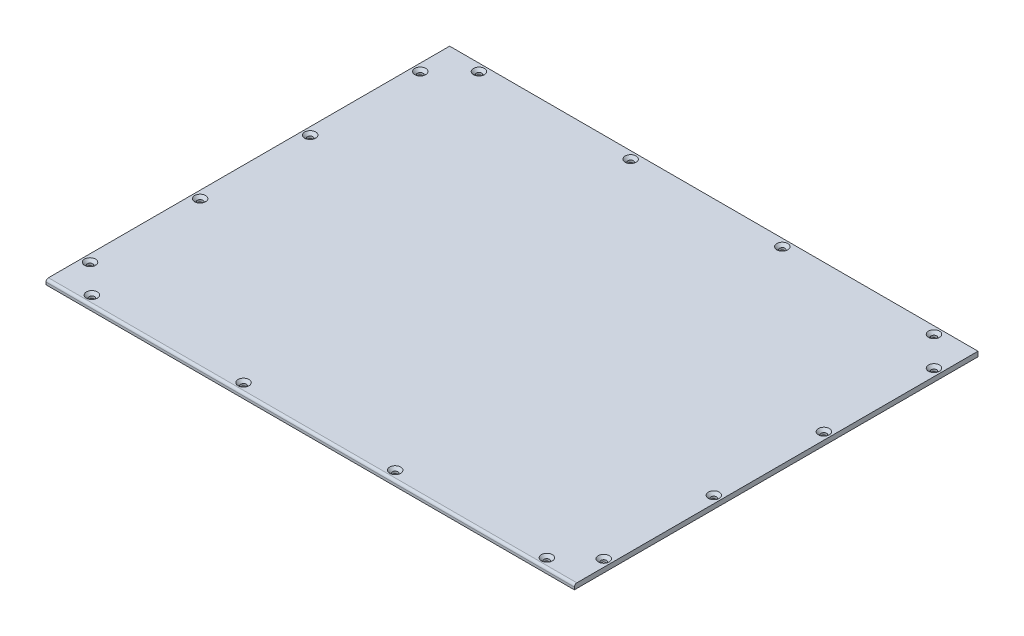
ISO-10303-21;
HEADER;
FILE_DESCRIPTION(('STEP AP214'),'2;1');
FILE_NAME('part.step','',(''),(''),'','','');
FILE_SCHEMA(('AUTOMOTIVE_DESIGN { 1 0 10303 214 1 1 1 1 }'));
ENDSEC;
DATA;
#1=APPLICATION_CONTEXT('core data for automotive mechanical design processes');
#2=APPLICATION_PROTOCOL_DEFINITION('international standard','automotive_design',2000,#1);
#3=PRODUCT_CONTEXT('',#1,'mechanical');
#4=PRODUCT('Part','Part','',(#3));
#5=PRODUCT_RELATED_PRODUCT_CATEGORY('part','',(#4));
#6=PRODUCT_DEFINITION_FORMATION('','',#4);
#7=PRODUCT_DEFINITION_CONTEXT('part definition',#1,'design');
#8=PRODUCT_DEFINITION('design','',#6,#7);
#9=PRODUCT_DEFINITION_SHAPE('','',#8);
#10=(LENGTH_UNIT() NAMED_UNIT(*) SI_UNIT(.MILLI.,.METRE.));
#11=(NAMED_UNIT(*) PLANE_ANGLE_UNIT() SI_UNIT($,.RADIAN.));
#12=(NAMED_UNIT(*) SI_UNIT($,.STERADIAN.) SOLID_ANGLE_UNIT());
#13=UNCERTAINTY_MEASURE_WITH_UNIT(LENGTH_MEASURE(1.E-05),#10,'distance_accuracy_value','');
#14=(GEOMETRIC_REPRESENTATION_CONTEXT(3) GLOBAL_UNCERTAINTY_ASSIGNED_CONTEXT((#13)) GLOBAL_UNIT_ASSIGNED_CONTEXT((#10,
#11,#12)) REPRESENTATION_CONTEXT('',''));
#15=CARTESIAN_POINT('',(0.,0.,0.));
#16=DIRECTION('',(0.,0.,1.));
#17=DIRECTION('',(1.,0.,0.));
#18=AXIS2_PLACEMENT_3D('',#15,#16,#17);
#19=CARTESIAN_POINT('',(0.,4.,0.));
#20=DIRECTION('',(1.,0.,0.));
#21=DIRECTION('',(0.,0.,-1.));
#22=AXIS2_PLACEMENT_3D('',#19,#20,#21);
#23=PLANE('',#22);
#24=DIRECTION('',(0.,-1.,0.));
#25=VECTOR('',#24,1.);
#26=CARTESIAN_POINT('',(0.,4.,0.));
#27=LINE('',#26,#25);
#28=CARTESIAN_POINT('',(0.,2.,0.));
#29=VERTEX_POINT('',#28);
#30=CARTESIAN_POINT('',(0.,0.,0.));
#31=VERTEX_POINT('',#30);
#32=EDGE_CURVE('E119',#29,#31,#27,.T.);
#33=ORIENTED_EDGE('',*,*,#32,.F.);
#34=CARTESIAN_POINT('',(0.,2.,-2.));
#35=DIRECTION('',(1.,0.,0.));
#36=DIRECTION('',(0.,0.,-1.));
#37=AXIS2_PLACEMENT_3D('',#34,#35,#36);
#38=CIRCLE('',#37,2.);
#39=CARTESIAN_POINT('',(0.,4.,-2.));
#40=VERTEX_POINT('',#39);
#41=EDGE_CURVE('E11',#29,#40,#38,.F.);
#42=ORIENTED_EDGE('',*,*,#41,.T.);
#43=DIRECTION('',(0.,0.,1.));
#44=VECTOR('',#43,1.);
#45=CARTESIAN_POINT('',(0.,4.,0.));
#46=LINE('',#45,#44);
#47=CARTESIAN_POINT('',(0.,4.,-330.));
#48=VERTEX_POINT('',#47);
#49=EDGE_CURVE('E89',#48,#40,#46,.T.);
#50=ORIENTED_EDGE('',*,*,#49,.F.);
#51=DIRECTION('',(0.,-1.,0.));
#52=VECTOR('',#51,1.);
#53=CARTESIAN_POINT('',(0.,4.,-330.));
#54=LINE('',#53,#52);
#55=CARTESIAN_POINT('',(0.,0.,-330.));
#56=VERTEX_POINT('',#55);
#57=EDGE_CURVE('E99',#48,#56,#54,.T.);
#58=ORIENTED_EDGE('',*,*,#57,.T.);
#59=DIRECTION('',(0.,0.,1.));
#60=VECTOR('',#59,1.);
#61=CARTESIAN_POINT('',(0.,0.,0.));
#62=LINE('',#61,#60);
#63=EDGE_CURVE('E108',#56,#31,#62,.T.);
#64=ORIENTED_EDGE('',*,*,#63,.T.);
#65=EDGE_LOOP('',(#33,#42,#50,#58,#64));
#66=FACE_BOUND('',#65,.T.);
#67=ADVANCED_FACE('F36',(#66),#23,.F.);
#68=CARTESIAN_POINT('',(0.,4.,0.));
#69=DIRECTION('',(0.,0.,-1.));
#70=DIRECTION('',(-1.,0.,0.));
#71=AXIS2_PLACEMENT_3D('',#68,#69,#70);
#72=PLANE('',#71);
#73=DIRECTION('',(0.,-1.,0.));
#74=VECTOR('',#73,1.);
#75=CARTESIAN_POINT('',(432.,4.,0.));
#76=LINE('',#75,#74);
#77=CARTESIAN_POINT('',(432.,2.,0.));
#78=VERTEX_POINT('',#77);
#79=CARTESIAN_POINT('',(432.,0.,0.));
#80=VERTEX_POINT('',#79);
#81=EDGE_CURVE('E98',#78,#80,#76,.T.);
#82=ORIENTED_EDGE('',*,*,#81,.F.);
#83=DIRECTION('',(1.,0.,0.));
#84=VECTOR('',#83,1.);
#85=CARTESIAN_POINT('',(0.,2.,0.));
#86=LINE('',#85,#84);
#87=EDGE_CURVE('E44',#78,#29,#86,.F.);
#88=ORIENTED_EDGE('',*,*,#87,.T.);
#89=ORIENTED_EDGE('',*,*,#32,.T.);
#90=DIRECTION('',(1.,0.,0.));
#91=VECTOR('',#90,1.);
#92=CARTESIAN_POINT('',(0.,0.,0.));
#93=LINE('',#92,#91);
#94=EDGE_CURVE('E111',#31,#80,#93,.T.);
#95=ORIENTED_EDGE('',*,*,#94,.T.);
#96=EDGE_LOOP('',(#82,#88,#89,#95));
#97=FACE_BOUND('',#96,.T.);
#98=ADVANCED_FACE('F123',(#97),#72,.F.);
#99=CARTESIAN_POINT('',(432.,4.,0.));
#100=DIRECTION('',(-1.,0.,0.));
#101=DIRECTION('',(0.,0.,1.));
#102=AXIS2_PLACEMENT_3D('',#99,#100,#101);
#103=PLANE('',#102);
#104=DIRECTION('',(0.,0.,-1.));
#105=VECTOR('',#104,1.);
#106=CARTESIAN_POINT('',(432.,4.,0.));
#107=LINE('',#106,#105);
#108=CARTESIAN_POINT('',(432.,4.,-2.));
#109=VERTEX_POINT('',#108);
#110=CARTESIAN_POINT('',(432.,4.,-330.));
#111=VERTEX_POINT('',#110);
#112=EDGE_CURVE('E80',#109,#111,#107,.T.);
#113=ORIENTED_EDGE('',*,*,#112,.F.);
#114=CARTESIAN_POINT('',(432.,2.,-2.));
#115=DIRECTION('',(-1.,0.,0.));
#116=DIRECTION('',(0.,0.,1.));
#117=AXIS2_PLACEMENT_3D('',#114,#115,#116);
#118=CIRCLE('',#117,2.);
#119=EDGE_CURVE('E58',#109,#78,#118,.F.);
#120=ORIENTED_EDGE('',*,*,#119,.T.);
#121=ORIENTED_EDGE('',*,*,#81,.T.);
#122=DIRECTION('',(0.,0.,-1.));
#123=VECTOR('',#122,1.);
#124=CARTESIAN_POINT('',(432.,0.,0.));
#125=LINE('',#124,#123);
#126=CARTESIAN_POINT('',(432.,0.,-330.));
#127=VERTEX_POINT('',#126);
#128=EDGE_CURVE('E95',#80,#127,#125,.T.);
#129=ORIENTED_EDGE('',*,*,#128,.T.);
#130=DIRECTION('',(0.,-1.,0.));
#131=VECTOR('',#130,1.);
#132=CARTESIAN_POINT('',(432.,4.,-330.));
#133=LINE('',#132,#131);
#134=EDGE_CURVE('E92',#111,#127,#133,.T.);
#135=ORIENTED_EDGE('',*,*,#134,.F.);
#136=EDGE_LOOP('',(#113,#120,#121,#129,#135));
#137=FACE_BOUND('',#136,.T.);
#138=ADVANCED_FACE('F93',(#137),#103,.F.);
#139=CARTESIAN_POINT('',(0.,4.,-330.));
#140=DIRECTION('',(0.,0.,1.));
#141=DIRECTION('',(1.,0.,0.));
#142=AXIS2_PLACEMENT_3D('',#139,#140,#141);
#143=PLANE('',#142);
#144=DIRECTION('',(-1.,0.,0.));
#145=VECTOR('',#144,1.);
#146=CARTESIAN_POINT('',(0.,0.,-330.));
#147=LINE('',#146,#145);
#148=EDGE_CURVE('E116',#127,#56,#147,.T.);
#149=ORIENTED_EDGE('',*,*,#148,.T.);
#150=ORIENTED_EDGE('',*,*,#57,.F.);
#151=DIRECTION('',(-1.,0.,0.));
#152=VECTOR('',#151,1.);
#153=CARTESIAN_POINT('',(0.,4.,-330.));
#154=LINE('',#153,#152);
#155=EDGE_CURVE('E85',#111,#48,#154,.T.);
#156=ORIENTED_EDGE('',*,*,#155,.F.);
#157=ORIENTED_EDGE('',*,*,#134,.T.);
#158=EDGE_LOOP('',(#149,#150,#156,#157));
#159=FACE_BOUND('',#158,.T.);
#160=ADVANCED_FACE('F101',(#159),#143,.F.);
#161=CARTESIAN_POINT('',(0.,4.,0.));
#162=DIRECTION('',(0.,-1.,0.));
#163=DIRECTION('',(0.,0.,-1.));
#164=AXIS2_PLACEMENT_3D('',#161,#162,#163);
#165=PLANE('',#164);
#166=CARTESIAN_POINT('',(6.,4.,-300.));
#167=DIRECTION('',(0.,1.,0.));
#168=DIRECTION('',(0.,0.,1.));
#169=AXIS2_PLACEMENT_3D('',#166,#167,#168);
#170=CIRCLE('',#169,4.48);
#171=CARTESIAN_POINT('',(6.,4.,-295.52));
#172=VERTEX_POINT('',#171);
#173=EDGE_CURVE('E270',#172,#172,#170,.T.);
#174=ORIENTED_EDGE('',*,*,#173,.F.);
#175=EDGE_LOOP('',(#174));
#176=FACE_BOUND('',#175,.T.);
#177=CARTESIAN_POINT('',(5.99999999999998,4.,-210.));
#178=DIRECTION('',(0.,1.,0.));
#179=DIRECTION('',(0.,0.,1.));
#180=AXIS2_PLACEMENT_3D('',#177,#178,#179);
#181=CIRCLE('',#180,4.48);
#182=CARTESIAN_POINT('',(5.99999999999998,4.,-205.52));
#183=VERTEX_POINT('',#182);
#184=EDGE_CURVE('E261',#183,#183,#181,.T.);
#185=ORIENTED_EDGE('',*,*,#184,.F.);
#186=EDGE_LOOP('',(#185));
#187=FACE_BOUND('',#186,.T.);
#188=CARTESIAN_POINT('',(5.99999999999998,4.,-120.));
#189=DIRECTION('',(0.,1.,0.));
#190=DIRECTION('',(0.,0.,1.));
#191=AXIS2_PLACEMENT_3D('',#188,#189,#190);
#192=CIRCLE('',#191,4.48);
#193=CARTESIAN_POINT('',(5.99999999999998,4.,-115.52));
#194=VERTEX_POINT('',#193);
#195=EDGE_CURVE('E252',#194,#194,#192,.T.);
#196=ORIENTED_EDGE('',*,*,#195,.F.);
#197=EDGE_LOOP('',(#196));
#198=FACE_BOUND('',#197,.T.);
#199=CARTESIAN_POINT('',(5.99999999999998,4.,-30.0000000000001));
#200=DIRECTION('',(0.,1.,0.));
#201=DIRECTION('',(0.,0.,1.));
#202=AXIS2_PLACEMENT_3D('',#199,#200,#201);
#203=CIRCLE('',#202,4.48);
#204=CARTESIAN_POINT('',(5.99999999999998,4.,-25.5200000000001));
#205=VERTEX_POINT('',#204);
#206=EDGE_CURVE('E243',#205,#205,#203,.T.);
#207=ORIENTED_EDGE('',*,*,#206,.F.);
#208=EDGE_LOOP('',(#207));
#209=FACE_BOUND('',#208,.T.);
#210=CARTESIAN_POINT('',(29.9999999999999,4.,-7.50000000000002));
#211=DIRECTION('',(0.,1.,0.));
#212=DIRECTION('',(0.,0.,1.));
#213=AXIS2_PLACEMENT_3D('',#210,#211,#212);
#214=CIRCLE('',#213,4.48);
#215=CARTESIAN_POINT('',(29.9999999999999,4.,-3.02000000000002));
#216=VERTEX_POINT('',#215);
#217=EDGE_CURVE('E234',#216,#216,#214,.T.);
#218=ORIENTED_EDGE('',*,*,#217,.F.);
#219=EDGE_LOOP('',(#218));
#220=FACE_BOUND('',#219,.T.);
#221=CARTESIAN_POINT('',(154.,4.,-7.5));
#222=DIRECTION('',(0.,1.,0.));
#223=DIRECTION('',(0.,0.,1.));
#224=AXIS2_PLACEMENT_3D('',#221,#222,#223);
#225=CIRCLE('',#224,4.48000000000001);
#226=CARTESIAN_POINT('',(154.,4.,-3.01999999999999));
#227=VERTEX_POINT('',#226);
#228=EDGE_CURVE('E225',#227,#227,#225,.T.);
#229=ORIENTED_EDGE('',*,*,#228,.F.);
#230=EDGE_LOOP('',(#229));
#231=FACE_BOUND('',#230,.T.);
#232=CARTESIAN_POINT('',(278.,4.,-7.5));
#233=DIRECTION('',(0.,1.,0.));
#234=DIRECTION('',(0.,0.,1.));
#235=AXIS2_PLACEMENT_3D('',#232,#233,#234);
#236=CIRCLE('',#235,4.47999999999998);
#237=CARTESIAN_POINT('',(278.,4.,-3.02000000000002));
#238=VERTEX_POINT('',#237);
#239=EDGE_CURVE('E216',#238,#238,#236,.T.);
#240=ORIENTED_EDGE('',*,*,#239,.F.);
#241=EDGE_LOOP('',(#240));
#242=FACE_BOUND('',#241,.T.);
#243=CARTESIAN_POINT('',(402.,4.,-7.5));
#244=DIRECTION('',(0.,1.,0.));
#245=DIRECTION('',(0.,0.,1.));
#246=AXIS2_PLACEMENT_3D('',#243,#244,#245);
#247=CIRCLE('',#246,4.47999999999998);
#248=CARTESIAN_POINT('',(402.,4.,-3.02000000000002));
#249=VERTEX_POINT('',#248);
#250=EDGE_CURVE('E207',#249,#249,#247,.T.);
#251=ORIENTED_EDGE('',*,*,#250,.F.);
#252=EDGE_LOOP('',(#251));
#253=FACE_BOUND('',#252,.T.);
#254=CARTESIAN_POINT('',(426.,4.,-30.0000000000001));
#255=DIRECTION('',(0.,1.,0.));
#256=DIRECTION('',(0.,0.,1.));
#257=AXIS2_PLACEMENT_3D('',#254,#255,#256);
#258=CIRCLE('',#257,4.47999999999998);
#259=CARTESIAN_POINT('',(426.,4.,-25.5200000000001));
#260=VERTEX_POINT('',#259);
#261=EDGE_CURVE('E198',#260,#260,#258,.T.);
#262=ORIENTED_EDGE('',*,*,#261,.F.);
#263=EDGE_LOOP('',(#262));
#264=FACE_BOUND('',#263,.T.);
#265=CARTESIAN_POINT('',(426.,4.,-120.));
#266=DIRECTION('',(0.,1.,0.));
#267=DIRECTION('',(0.,0.,1.));
#268=AXIS2_PLACEMENT_3D('',#265,#266,#267);
#269=CIRCLE('',#268,4.47999999999998);
#270=CARTESIAN_POINT('',(426.,4.,-115.52));
#271=VERTEX_POINT('',#270);
#272=EDGE_CURVE('E189',#271,#271,#269,.T.);
#273=ORIENTED_EDGE('',*,*,#272,.F.);
#274=EDGE_LOOP('',(#273));
#275=FACE_BOUND('',#274,.T.);
#276=CARTESIAN_POINT('',(426.,4.,-210.));
#277=DIRECTION('',(0.,1.,0.));
#278=DIRECTION('',(0.,0.,1.));
#279=AXIS2_PLACEMENT_3D('',#276,#277,#278);
#280=CIRCLE('',#279,4.47999999999998);
#281=CARTESIAN_POINT('',(426.,4.,-205.52));
#282=VERTEX_POINT('',#281);
#283=EDGE_CURVE('E180',#282,#282,#280,.T.);
#284=ORIENTED_EDGE('',*,*,#283,.F.);
#285=EDGE_LOOP('',(#284));
#286=FACE_BOUND('',#285,.T.);
#287=CARTESIAN_POINT('',(426.,4.,-300.));
#288=DIRECTION('',(0.,1.,0.));
#289=DIRECTION('',(0.,0.,1.));
#290=AXIS2_PLACEMENT_3D('',#287,#288,#289);
#291=CIRCLE('',#290,4.47999999999998);
#292=CARTESIAN_POINT('',(426.,4.,-295.52));
#293=VERTEX_POINT('',#292);
#294=EDGE_CURVE('E171',#293,#293,#291,.T.);
#295=ORIENTED_EDGE('',*,*,#294,.F.);
#296=EDGE_LOOP('',(#295));
#297=FACE_BOUND('',#296,.T.);
#298=CARTESIAN_POINT('',(402.,4.,-324.));
#299=DIRECTION('',(0.,1.,0.));
#300=DIRECTION('',(0.,0.,1.));
#301=AXIS2_PLACEMENT_3D('',#298,#299,#300);
#302=CIRCLE('',#301,4.47999999999998);
#303=CARTESIAN_POINT('',(402.,4.,-319.52));
#304=VERTEX_POINT('',#303);
#305=EDGE_CURVE('E162',#304,#304,#302,.T.);
#306=ORIENTED_EDGE('',*,*,#305,.F.);
#307=EDGE_LOOP('',(#306));
#308=FACE_BOUND('',#307,.T.);
#309=CARTESIAN_POINT('',(278.,4.,-324.));
#310=DIRECTION('',(0.,1.,0.));
#311=DIRECTION('',(0.,0.,1.));
#312=AXIS2_PLACEMENT_3D('',#309,#310,#311);
#313=CIRCLE('',#312,4.47999999999998);
#314=CARTESIAN_POINT('',(278.,4.,-319.52));
#315=VERTEX_POINT('',#314);
#316=EDGE_CURVE('E153',#315,#315,#313,.T.);
#317=ORIENTED_EDGE('',*,*,#316,.F.);
#318=EDGE_LOOP('',(#317));
#319=FACE_BOUND('',#318,.T.);
#320=CARTESIAN_POINT('',(154.,4.,-324.));
#321=DIRECTION('',(0.,1.,0.));
#322=DIRECTION('',(0.,0.,1.));
#323=AXIS2_PLACEMENT_3D('',#320,#321,#322);
#324=CIRCLE('',#323,4.48000000000001);
#325=CARTESIAN_POINT('',(154.,4.,-319.52));
#326=VERTEX_POINT('',#325);
#327=EDGE_CURVE('E144',#326,#326,#324,.T.);
#328=ORIENTED_EDGE('',*,*,#327,.F.);
#329=EDGE_LOOP('',(#328));
#330=FACE_BOUND('',#329,.T.);
#331=CARTESIAN_POINT('',(29.9999999999999,4.,-324.));
#332=DIRECTION('',(0.,1.,0.));
#333=DIRECTION('',(0.,0.,1.));
#334=AXIS2_PLACEMENT_3D('',#331,#332,#333);
#335=CIRCLE('',#334,4.48);
#336=CARTESIAN_POINT('',(29.9999999999999,4.,-319.52));
#337=VERTEX_POINT('',#336);
#338=EDGE_CURVE('E135',#337,#337,#335,.T.);
#339=ORIENTED_EDGE('',*,*,#338,.F.);
#340=EDGE_LOOP('',(#339));
#341=FACE_BOUND('',#340,.T.);
#342=ORIENTED_EDGE('',*,*,#49,.T.);
#343=DIRECTION('',(1.,0.,0.));
#344=VECTOR('',#343,1.);
#345=CARTESIAN_POINT('',(0.,4.,-2.));
#346=LINE('',#345,#344);
#347=EDGE_CURVE('E88',#40,#109,#346,.T.);
#348=ORIENTED_EDGE('',*,*,#347,.T.);
#349=ORIENTED_EDGE('',*,*,#112,.T.);
#350=ORIENTED_EDGE('',*,*,#155,.T.);
#351=EDGE_LOOP('',(#342,#348,#349,#350));
#352=FACE_BOUND('',#351,.T.);
#353=ADVANCED_FACE('F83',(#176,#187,#198,#209,#220,#231,#242,#253,#264,#275,#286,#297,#308,#319,
#330,#341,#352),#165,.F.);
#354=CARTESIAN_POINT('',(0.,0.,0.));
#355=DIRECTION('',(0.,-1.,0.));
#356=DIRECTION('',(0.,0.,-1.));
#357=AXIS2_PLACEMENT_3D('',#354,#355,#356);
#358=PLANE('',#357);
#359=CARTESIAN_POINT('',(6.,0.,-300.));
#360=DIRECTION('',(0.,1.,0.));
#361=DIRECTION('',(0.,0.,1.));
#362=AXIS2_PLACEMENT_3D('',#359,#360,#361);
#363=CIRCLE('',#362,2.25);
#364=CARTESIAN_POINT('',(6.,0.,-297.75));
#365=VERTEX_POINT('',#364);
#366=EDGE_CURVE('E264',#365,#365,#363,.T.);
#367=ORIENTED_EDGE('',*,*,#366,.T.);
#368=EDGE_LOOP('',(#367));
#369=FACE_BOUND('',#368,.T.);
#370=CARTESIAN_POINT('',(5.99999999999998,0.,-210.));
#371=DIRECTION('',(0.,1.,0.));
#372=DIRECTION('',(0.,0.,1.));
#373=AXIS2_PLACEMENT_3D('',#370,#371,#372);
#374=CIRCLE('',#373,2.25);
#375=CARTESIAN_POINT('',(5.99999999999998,0.,-207.75));
#376=VERTEX_POINT('',#375);
#377=EDGE_CURVE('E255',#376,#376,#374,.T.);
#378=ORIENTED_EDGE('',*,*,#377,.T.);
#379=EDGE_LOOP('',(#378));
#380=FACE_BOUND('',#379,.T.);
#381=CARTESIAN_POINT('',(5.99999999999998,0.,-120.));
#382=DIRECTION('',(0.,1.,0.));
#383=DIRECTION('',(0.,0.,1.));
#384=AXIS2_PLACEMENT_3D('',#381,#382,#383);
#385=CIRCLE('',#384,2.25);
#386=CARTESIAN_POINT('',(5.99999999999998,0.,-117.75));
#387=VERTEX_POINT('',#386);
#388=EDGE_CURVE('E246',#387,#387,#385,.T.);
#389=ORIENTED_EDGE('',*,*,#388,.T.);
#390=EDGE_LOOP('',(#389));
#391=FACE_BOUND('',#390,.T.);
#392=CARTESIAN_POINT('',(5.99999999999998,0.,-30.0000000000001));
#393=DIRECTION('',(0.,1.,0.));
#394=DIRECTION('',(0.,0.,1.));
#395=AXIS2_PLACEMENT_3D('',#392,#393,#394);
#396=CIRCLE('',#395,2.25);
#397=CARTESIAN_POINT('',(5.99999999999998,0.,-27.7500000000001));
#398=VERTEX_POINT('',#397);
#399=EDGE_CURVE('E237',#398,#398,#396,.T.);
#400=ORIENTED_EDGE('',*,*,#399,.T.);
#401=EDGE_LOOP('',(#400));
#402=FACE_BOUND('',#401,.T.);
#403=CARTESIAN_POINT('',(29.9999999999999,0.,-7.50000000000002));
#404=DIRECTION('',(0.,1.,0.));
#405=DIRECTION('',(0.,0.,1.));
#406=AXIS2_PLACEMENT_3D('',#403,#404,#405);
#407=CIRCLE('',#406,2.25);
#408=CARTESIAN_POINT('',(29.9999999999999,0.,-5.25000000000002));
#409=VERTEX_POINT('',#408);
#410=EDGE_CURVE('E228',#409,#409,#407,.T.);
#411=ORIENTED_EDGE('',*,*,#410,.T.);
#412=EDGE_LOOP('',(#411));
#413=FACE_BOUND('',#412,.T.);
#414=CARTESIAN_POINT('',(154.,0.,-7.5));
#415=DIRECTION('',(0.,1.,0.));
#416=DIRECTION('',(0.,0.,1.));
#417=AXIS2_PLACEMENT_3D('',#414,#415,#416);
#418=CIRCLE('',#417,2.25);
#419=CARTESIAN_POINT('',(154.,0.,-5.25));
#420=VERTEX_POINT('',#419);
#421=EDGE_CURVE('E219',#420,#420,#418,.T.);
#422=ORIENTED_EDGE('',*,*,#421,.T.);
#423=EDGE_LOOP('',(#422));
#424=FACE_BOUND('',#423,.T.);
#425=CARTESIAN_POINT('',(278.,0.,-7.5));
#426=DIRECTION('',(0.,1.,0.));
#427=DIRECTION('',(0.,0.,1.));
#428=AXIS2_PLACEMENT_3D('',#425,#426,#427);
#429=CIRCLE('',#428,2.24999999999997);
#430=CARTESIAN_POINT('',(278.,0.,-5.25000000000003));
#431=VERTEX_POINT('',#430);
#432=EDGE_CURVE('E210',#431,#431,#429,.T.);
#433=ORIENTED_EDGE('',*,*,#432,.T.);
#434=EDGE_LOOP('',(#433));
#435=FACE_BOUND('',#434,.T.);
#436=CARTESIAN_POINT('',(402.,0.,-7.5));
#437=DIRECTION('',(0.,1.,0.));
#438=DIRECTION('',(0.,0.,1.));
#439=AXIS2_PLACEMENT_3D('',#436,#437,#438);
#440=CIRCLE('',#439,2.24999999999997);
#441=CARTESIAN_POINT('',(402.,0.,-5.25000000000003));
#442=VERTEX_POINT('',#441);
#443=EDGE_CURVE('E201',#442,#442,#440,.T.);
#444=ORIENTED_EDGE('',*,*,#443,.T.);
#445=EDGE_LOOP('',(#444));
#446=FACE_BOUND('',#445,.T.);
#447=CARTESIAN_POINT('',(426.,0.,-30.0000000000001));
#448=DIRECTION('',(0.,1.,0.));
#449=DIRECTION('',(0.,0.,1.));
#450=AXIS2_PLACEMENT_3D('',#447,#448,#449);
#451=CIRCLE('',#450,2.24999999999997);
#452=CARTESIAN_POINT('',(426.,0.,-27.7500000000001));
#453=VERTEX_POINT('',#452);
#454=EDGE_CURVE('E192',#453,#453,#451,.T.);
#455=ORIENTED_EDGE('',*,*,#454,.T.);
#456=EDGE_LOOP('',(#455));
#457=FACE_BOUND('',#456,.T.);
#458=CARTESIAN_POINT('',(426.,0.,-120.));
#459=DIRECTION('',(0.,1.,0.));
#460=DIRECTION('',(0.,0.,1.));
#461=AXIS2_PLACEMENT_3D('',#458,#459,#460);
#462=CIRCLE('',#461,2.24999999999997);
#463=CARTESIAN_POINT('',(426.,0.,-117.75));
#464=VERTEX_POINT('',#463);
#465=EDGE_CURVE('E183',#464,#464,#462,.T.);
#466=ORIENTED_EDGE('',*,*,#465,.T.);
#467=EDGE_LOOP('',(#466));
#468=FACE_BOUND('',#467,.T.);
#469=CARTESIAN_POINT('',(426.,0.,-210.));
#470=DIRECTION('',(0.,1.,0.));
#471=DIRECTION('',(0.,0.,1.));
#472=AXIS2_PLACEMENT_3D('',#469,#470,#471);
#473=CIRCLE('',#472,2.24999999999997);
#474=CARTESIAN_POINT('',(426.,0.,-207.75));
#475=VERTEX_POINT('',#474);
#476=EDGE_CURVE('E174',#475,#475,#473,.T.);
#477=ORIENTED_EDGE('',*,*,#476,.T.);
#478=EDGE_LOOP('',(#477));
#479=FACE_BOUND('',#478,.T.);
#480=CARTESIAN_POINT('',(426.,0.,-300.));
#481=DIRECTION('',(0.,1.,0.));
#482=DIRECTION('',(0.,0.,1.));
#483=AXIS2_PLACEMENT_3D('',#480,#481,#482);
#484=CIRCLE('',#483,2.24999999999997);
#485=CARTESIAN_POINT('',(426.,0.,-297.75));
#486=VERTEX_POINT('',#485);
#487=EDGE_CURVE('E165',#486,#486,#484,.T.);
#488=ORIENTED_EDGE('',*,*,#487,.T.);
#489=EDGE_LOOP('',(#488));
#490=FACE_BOUND('',#489,.T.);
#491=CARTESIAN_POINT('',(402.,0.,-324.));
#492=DIRECTION('',(0.,1.,0.));
#493=DIRECTION('',(0.,0.,1.));
#494=AXIS2_PLACEMENT_3D('',#491,#492,#493);
#495=CIRCLE('',#494,2.24999999999997);
#496=CARTESIAN_POINT('',(402.,0.,-321.75));
#497=VERTEX_POINT('',#496);
#498=EDGE_CURVE('E156',#497,#497,#495,.T.);
#499=ORIENTED_EDGE('',*,*,#498,.T.);
#500=EDGE_LOOP('',(#499));
#501=FACE_BOUND('',#500,.T.);
#502=CARTESIAN_POINT('',(278.,0.,-324.));
#503=DIRECTION('',(0.,1.,0.));
#504=DIRECTION('',(0.,0.,1.));
#505=AXIS2_PLACEMENT_3D('',#502,#503,#504);
#506=CIRCLE('',#505,2.24999999999997);
#507=CARTESIAN_POINT('',(278.,0.,-321.75));
#508=VERTEX_POINT('',#507);
#509=EDGE_CURVE('E147',#508,#508,#506,.T.);
#510=ORIENTED_EDGE('',*,*,#509,.T.);
#511=EDGE_LOOP('',(#510));
#512=FACE_BOUND('',#511,.T.);
#513=CARTESIAN_POINT('',(154.,0.,-324.));
#514=DIRECTION('',(0.,1.,0.));
#515=DIRECTION('',(0.,0.,1.));
#516=AXIS2_PLACEMENT_3D('',#513,#514,#515);
#517=CIRCLE('',#516,2.25);
#518=CARTESIAN_POINT('',(154.,0.,-321.75));
#519=VERTEX_POINT('',#518);
#520=EDGE_CURVE('E138',#519,#519,#517,.T.);
#521=ORIENTED_EDGE('',*,*,#520,.T.);
#522=EDGE_LOOP('',(#521));
#523=FACE_BOUND('',#522,.T.);
#524=CARTESIAN_POINT('',(29.9999999999999,0.,-324.));
#525=DIRECTION('',(0.,1.,0.));
#526=DIRECTION('',(0.,0.,1.));
#527=AXIS2_PLACEMENT_3D('',#524,#525,#526);
#528=CIRCLE('',#527,2.25);
#529=CARTESIAN_POINT('',(29.9999999999999,0.,-321.75));
#530=VERTEX_POINT('',#529);
#531=EDGE_CURVE('E112',#530,#530,#528,.T.);
#532=ORIENTED_EDGE('',*,*,#531,.T.);
#533=EDGE_LOOP('',(#532));
#534=FACE_BOUND('',#533,.T.);
#535=ORIENTED_EDGE('',*,*,#63,.F.);
#536=ORIENTED_EDGE('',*,*,#148,.F.);
#537=ORIENTED_EDGE('',*,*,#128,.F.);
#538=ORIENTED_EDGE('',*,*,#94,.F.);
#539=EDGE_LOOP('',(#535,#536,#537,#538));
#540=FACE_BOUND('',#539,.T.);
#541=ADVANCED_FACE('F128',(#369,#380,#391,#402,#413,#424,#435,#446,#457,#468,#479,#490,#501,
#512,#523,#534,#540),#358,.T.);
#542=CARTESIAN_POINT('',(29.9999999999999,4.,-324.));
#543=DIRECTION('',(0.,1.,0.));
#544=DIRECTION('',(0.,0.,1.));
#545=AXIS2_PLACEMENT_3D('',#542,#543,#544);
#546=CYLINDRICAL_SURFACE('',#545,2.25);
#547=ORIENTED_EDGE('',*,*,#531,.F.);
#548=EDGE_LOOP('',(#547));
#549=FACE_BOUND('',#548,.T.);
#550=CARTESIAN_POINT('',(29.9999999999999,1.77,-324.));
#551=DIRECTION('',(0.,1.,0.));
#552=DIRECTION('',(0.,0.,1.));
#553=AXIS2_PLACEMENT_3D('',#550,#551,#552);
#554=CIRCLE('',#553,2.25);
#555=CARTESIAN_POINT('',(29.9999999999999,1.77,-321.75));
#556=VERTEX_POINT('',#555);
#557=EDGE_CURVE('E132',#556,#556,#554,.T.);
#558=ORIENTED_EDGE('',*,*,#557,.T.);
#559=EDGE_LOOP('',(#558));
#560=FACE_BOUND('',#559,.T.);
#561=ADVANCED_FACE('F312',(#549,#560),#546,.F.);
#562=CARTESIAN_POINT('',(29.9999999999999,4.,-324.));
#563=DIRECTION('',(0.,1.,0.));
#564=DIRECTION('',(0.,0.,1.));
#565=AXIS2_PLACEMENT_3D('',#562,#563,#564);
#566=CONICAL_SURFACE('',#565,4.48,0.785398163397448);
#567=ORIENTED_EDGE('',*,*,#557,.F.);
#568=EDGE_LOOP('',(#567));
#569=FACE_BOUND('',#568,.T.);
#570=ORIENTED_EDGE('',*,*,#338,.T.);
#571=EDGE_LOOP('',(#570));
#572=FACE_BOUND('',#571,.T.);
#573=ADVANCED_FACE('F309',(#569,#572),#566,.F.);
#574=CARTESIAN_POINT('',(154.,4.,-324.));
#575=DIRECTION('',(0.,1.,0.));
#576=DIRECTION('',(0.,0.,1.));
#577=AXIS2_PLACEMENT_3D('',#574,#575,#576);
#578=CYLINDRICAL_SURFACE('',#577,2.25);
#579=ORIENTED_EDGE('',*,*,#520,.F.);
#580=EDGE_LOOP('',(#579));
#581=FACE_BOUND('',#580,.T.);
#582=CARTESIAN_POINT('',(154.,1.77,-324.));
#583=DIRECTION('',(0.,1.,0.));
#584=DIRECTION('',(0.,0.,1.));
#585=AXIS2_PLACEMENT_3D('',#582,#583,#584);
#586=CIRCLE('',#585,2.25);
#587=CARTESIAN_POINT('',(154.,1.77,-321.75));
#588=VERTEX_POINT('',#587);
#589=EDGE_CURVE('E141',#588,#588,#586,.T.);
#590=ORIENTED_EDGE('',*,*,#589,.T.);
#591=EDGE_LOOP('',(#590));
#592=FACE_BOUND('',#591,.T.);
#593=ADVANCED_FACE('F311',(#581,#592),#578,.F.);
#594=CARTESIAN_POINT('',(154.,4.,-324.));
#595=DIRECTION('',(0.,1.,0.));
#596=DIRECTION('',(0.,0.,1.));
#597=AXIS2_PLACEMENT_3D('',#594,#595,#596);
#598=CONICAL_SURFACE('',#597,4.48000000000001,0.785398163397451);
#599=ORIENTED_EDGE('',*,*,#589,.F.);
#600=EDGE_LOOP('',(#599));
#601=FACE_BOUND('',#600,.T.);
#602=ORIENTED_EDGE('',*,*,#327,.T.);
#603=EDGE_LOOP('',(#602));
#604=FACE_BOUND('',#603,.T.);
#605=ADVANCED_FACE('F319',(#601,#604),#598,.F.);
#606=CARTESIAN_POINT('',(278.,4.,-324.));
#607=DIRECTION('',(0.,1.,0.));
#608=DIRECTION('',(0.,0.,1.));
#609=AXIS2_PLACEMENT_3D('',#606,#607,#608);
#610=CYLINDRICAL_SURFACE('',#609,2.24999999999997);
#611=ORIENTED_EDGE('',*,*,#509,.F.);
#612=EDGE_LOOP('',(#611));
#613=FACE_BOUND('',#612,.T.);
#614=CARTESIAN_POINT('',(278.,1.77,-324.));
#615=DIRECTION('',(0.,1.,0.));
#616=DIRECTION('',(0.,0.,1.));
#617=AXIS2_PLACEMENT_3D('',#614,#615,#616);
#618=CIRCLE('',#617,2.24999999999997);
#619=CARTESIAN_POINT('',(278.,1.77,-321.75));
#620=VERTEX_POINT('',#619);
#621=EDGE_CURVE('E150',#620,#620,#618,.T.);
#622=ORIENTED_EDGE('',*,*,#621,.T.);
#623=EDGE_LOOP('',(#622));
#624=FACE_BOUND('',#623,.T.);
#625=ADVANCED_FACE('F376',(#613,#624),#610,.F.);
#626=CARTESIAN_POINT('',(278.,4.,-324.));
#627=DIRECTION('',(0.,1.,0.));
#628=DIRECTION('',(0.,0.,1.));
#629=AXIS2_PLACEMENT_3D('',#626,#627,#628);
#630=CONICAL_SURFACE('',#629,4.47999999999998,0.785398163397451);
#631=ORIENTED_EDGE('',*,*,#621,.F.);
#632=EDGE_LOOP('',(#631));
#633=FACE_BOUND('',#632,.T.);
#634=ORIENTED_EDGE('',*,*,#316,.T.);
#635=EDGE_LOOP('',(#634));
#636=FACE_BOUND('',#635,.T.);
#637=ADVANCED_FACE('F381',(#633,#636),#630,.F.);
#638=CARTESIAN_POINT('',(402.,4.,-324.));
#639=DIRECTION('',(0.,1.,0.));
#640=DIRECTION('',(0.,0.,1.));
#641=AXIS2_PLACEMENT_3D('',#638,#639,#640);
#642=CYLINDRICAL_SURFACE('',#641,2.24999999999997);
#643=ORIENTED_EDGE('',*,*,#498,.F.);
#644=EDGE_LOOP('',(#643));
#645=FACE_BOUND('',#644,.T.);
#646=CARTESIAN_POINT('',(402.,1.77,-324.));
#647=DIRECTION('',(0.,1.,0.));
#648=DIRECTION('',(0.,0.,1.));
#649=AXIS2_PLACEMENT_3D('',#646,#647,#648);
#650=CIRCLE('',#649,2.24999999999997);
#651=CARTESIAN_POINT('',(402.,1.77,-321.75));
#652=VERTEX_POINT('',#651);
#653=EDGE_CURVE('E159',#652,#652,#650,.T.);
#654=ORIENTED_EDGE('',*,*,#653,.T.);
#655=EDGE_LOOP('',(#654));
#656=FACE_BOUND('',#655,.T.);
#657=ADVANCED_FACE('F387',(#645,#656),#642,.F.);
#658=CARTESIAN_POINT('',(402.,4.,-324.));
#659=DIRECTION('',(0.,1.,0.));
#660=DIRECTION('',(0.,0.,1.));
#661=AXIS2_PLACEMENT_3D('',#658,#659,#660);
#662=CONICAL_SURFACE('',#661,4.47999999999998,0.785398163397451);
#663=ORIENTED_EDGE('',*,*,#653,.F.);
#664=EDGE_LOOP('',(#663));
#665=FACE_BOUND('',#664,.T.);
#666=ORIENTED_EDGE('',*,*,#305,.T.);
#667=EDGE_LOOP('',(#666));
#668=FACE_BOUND('',#667,.T.);
#669=ADVANCED_FACE('F391',(#665,#668),#662,.F.);
#670=CARTESIAN_POINT('',(426.,4.,-300.));
#671=DIRECTION('',(0.,1.,0.));
#672=DIRECTION('',(0.,0.,1.));
#673=AXIS2_PLACEMENT_3D('',#670,#671,#672);
#674=CYLINDRICAL_SURFACE('',#673,2.24999999999997);
#675=ORIENTED_EDGE('',*,*,#487,.F.);
#676=EDGE_LOOP('',(#675));
#677=FACE_BOUND('',#676,.T.);
#678=CARTESIAN_POINT('',(426.,1.77,-300.));
#679=DIRECTION('',(0.,1.,0.));
#680=DIRECTION('',(0.,0.,1.));
#681=AXIS2_PLACEMENT_3D('',#678,#679,#680);
#682=CIRCLE('',#681,2.24999999999997);
#683=CARTESIAN_POINT('',(426.,1.77,-297.75));
#684=VERTEX_POINT('',#683);
#685=EDGE_CURVE('E168',#684,#684,#682,.T.);
#686=ORIENTED_EDGE('',*,*,#685,.T.);
#687=EDGE_LOOP('',(#686));
#688=FACE_BOUND('',#687,.T.);
#689=ADVANCED_FACE('F395',(#677,#688),#674,.F.);
#690=CARTESIAN_POINT('',(426.,4.,-300.));
#691=DIRECTION('',(0.,1.,0.));
#692=DIRECTION('',(0.,0.,1.));
#693=AXIS2_PLACEMENT_3D('',#690,#691,#692);
#694=CONICAL_SURFACE('',#693,4.47999999999998,0.785398163397451);
#695=ORIENTED_EDGE('',*,*,#685,.F.);
#696=EDGE_LOOP('',(#695));
#697=FACE_BOUND('',#696,.T.);
#698=ORIENTED_EDGE('',*,*,#294,.T.);
#699=EDGE_LOOP('',(#698));
#700=FACE_BOUND('',#699,.T.);
#701=ADVANCED_FACE('F399',(#697,#700),#694,.F.);
#702=CARTESIAN_POINT('',(426.,4.,-210.));
#703=DIRECTION('',(0.,1.,0.));
#704=DIRECTION('',(0.,0.,1.));
#705=AXIS2_PLACEMENT_3D('',#702,#703,#704);
#706=CYLINDRICAL_SURFACE('',#705,2.24999999999997);
#707=ORIENTED_EDGE('',*,*,#476,.F.);
#708=EDGE_LOOP('',(#707));
#709=FACE_BOUND('',#708,.T.);
#710=CARTESIAN_POINT('',(426.,1.77,-210.));
#711=DIRECTION('',(0.,1.,0.));
#712=DIRECTION('',(0.,0.,1.));
#713=AXIS2_PLACEMENT_3D('',#710,#711,#712);
#714=CIRCLE('',#713,2.24999999999997);
#715=CARTESIAN_POINT('',(426.,1.77,-207.75));
#716=VERTEX_POINT('',#715);
#717=EDGE_CURVE('E177',#716,#716,#714,.T.);
#718=ORIENTED_EDGE('',*,*,#717,.T.);
#719=EDGE_LOOP('',(#718));
#720=FACE_BOUND('',#719,.T.);
#721=ADVANCED_FACE('F403',(#709,#720),#706,.F.);
#722=CARTESIAN_POINT('',(426.,4.,-210.));
#723=DIRECTION('',(0.,1.,0.));
#724=DIRECTION('',(0.,0.,1.));
#725=AXIS2_PLACEMENT_3D('',#722,#723,#724);
#726=CONICAL_SURFACE('',#725,4.47999999999998,0.785398163397451);
#727=ORIENTED_EDGE('',*,*,#717,.F.);
#728=EDGE_LOOP('',(#727));
#729=FACE_BOUND('',#728,.T.);
#730=ORIENTED_EDGE('',*,*,#283,.T.);
#731=EDGE_LOOP('',(#730));
#732=FACE_BOUND('',#731,.T.);
#733=ADVANCED_FACE('F407',(#729,#732),#726,.F.);
#734=CARTESIAN_POINT('',(426.,4.,-120.));
#735=DIRECTION('',(0.,1.,0.));
#736=DIRECTION('',(0.,0.,1.));
#737=AXIS2_PLACEMENT_3D('',#734,#735,#736);
#738=CYLINDRICAL_SURFACE('',#737,2.24999999999997);
#739=ORIENTED_EDGE('',*,*,#465,.F.);
#740=EDGE_LOOP('',(#739));
#741=FACE_BOUND('',#740,.T.);
#742=CARTESIAN_POINT('',(426.,1.77,-120.));
#743=DIRECTION('',(0.,1.,0.));
#744=DIRECTION('',(0.,0.,1.));
#745=AXIS2_PLACEMENT_3D('',#742,#743,#744);
#746=CIRCLE('',#745,2.24999999999997);
#747=CARTESIAN_POINT('',(426.,1.77,-117.75));
#748=VERTEX_POINT('',#747);
#749=EDGE_CURVE('E186',#748,#748,#746,.T.);
#750=ORIENTED_EDGE('',*,*,#749,.T.);
#751=EDGE_LOOP('',(#750));
#752=FACE_BOUND('',#751,.T.);
#753=ADVANCED_FACE('F411',(#741,#752),#738,.F.);
#754=CARTESIAN_POINT('',(426.,4.,-120.));
#755=DIRECTION('',(0.,1.,0.));
#756=DIRECTION('',(0.,0.,1.));
#757=AXIS2_PLACEMENT_3D('',#754,#755,#756);
#758=CONICAL_SURFACE('',#757,4.47999999999998,0.785398163397451);
#759=ORIENTED_EDGE('',*,*,#749,.F.);
#760=EDGE_LOOP('',(#759));
#761=FACE_BOUND('',#760,.T.);
#762=ORIENTED_EDGE('',*,*,#272,.T.);
#763=EDGE_LOOP('',(#762));
#764=FACE_BOUND('',#763,.T.);
#765=ADVANCED_FACE('F415',(#761,#764),#758,.F.);
#766=CARTESIAN_POINT('',(426.,4.,-30.0000000000001));
#767=DIRECTION('',(0.,1.,0.));
#768=DIRECTION('',(0.,0.,1.));
#769=AXIS2_PLACEMENT_3D('',#766,#767,#768);
#770=CYLINDRICAL_SURFACE('',#769,2.24999999999997);
#771=ORIENTED_EDGE('',*,*,#454,.F.);
#772=EDGE_LOOP('',(#771));
#773=FACE_BOUND('',#772,.T.);
#774=CARTESIAN_POINT('',(426.,1.77,-30.0000000000001));
#775=DIRECTION('',(0.,1.,0.));
#776=DIRECTION('',(0.,0.,1.));
#777=AXIS2_PLACEMENT_3D('',#774,#775,#776);
#778=CIRCLE('',#777,2.24999999999997);
#779=CARTESIAN_POINT('',(426.,1.77,-27.7500000000001));
#780=VERTEX_POINT('',#779);
#781=EDGE_CURVE('E195',#780,#780,#778,.T.);
#782=ORIENTED_EDGE('',*,*,#781,.T.);
#783=EDGE_LOOP('',(#782));
#784=FACE_BOUND('',#783,.T.);
#785=ADVANCED_FACE('F419',(#773,#784),#770,.F.);
#786=CARTESIAN_POINT('',(426.,4.,-30.0000000000001));
#787=DIRECTION('',(0.,1.,0.));
#788=DIRECTION('',(0.,0.,1.));
#789=AXIS2_PLACEMENT_3D('',#786,#787,#788);
#790=CONICAL_SURFACE('',#789,4.47999999999998,0.785398163397451);
#791=ORIENTED_EDGE('',*,*,#781,.F.);
#792=EDGE_LOOP('',(#791));
#793=FACE_BOUND('',#792,.T.);
#794=ORIENTED_EDGE('',*,*,#261,.T.);
#795=EDGE_LOOP('',(#794));
#796=FACE_BOUND('',#795,.T.);
#797=ADVANCED_FACE('F423',(#793,#796),#790,.F.);
#798=CARTESIAN_POINT('',(402.,4.,-7.5));
#799=DIRECTION('',(0.,1.,0.));
#800=DIRECTION('',(0.,0.,1.));
#801=AXIS2_PLACEMENT_3D('',#798,#799,#800);
#802=CYLINDRICAL_SURFACE('',#801,2.24999999999997);
#803=ORIENTED_EDGE('',*,*,#443,.F.);
#804=EDGE_LOOP('',(#803));
#805=FACE_BOUND('',#804,.T.);
#806=CARTESIAN_POINT('',(402.,1.77,-7.5));
#807=DIRECTION('',(0.,1.,0.));
#808=DIRECTION('',(0.,0.,1.));
#809=AXIS2_PLACEMENT_3D('',#806,#807,#808);
#810=CIRCLE('',#809,2.24999999999997);
#811=CARTESIAN_POINT('',(402.,1.77,-5.25000000000003));
#812=VERTEX_POINT('',#811);
#813=EDGE_CURVE('E204',#812,#812,#810,.T.);
#814=ORIENTED_EDGE('',*,*,#813,.T.);
#815=EDGE_LOOP('',(#814));
#816=FACE_BOUND('',#815,.T.);
#817=ADVANCED_FACE('F427',(#805,#816),#802,.F.);
#818=CARTESIAN_POINT('',(402.,4.,-7.5));
#819=DIRECTION('',(0.,1.,0.));
#820=DIRECTION('',(0.,0.,1.));
#821=AXIS2_PLACEMENT_3D('',#818,#819,#820);
#822=CONICAL_SURFACE('',#821,4.47999999999998,0.785398163397451);
#823=ORIENTED_EDGE('',*,*,#813,.F.);
#824=EDGE_LOOP('',(#823));
#825=FACE_BOUND('',#824,.T.);
#826=ORIENTED_EDGE('',*,*,#250,.T.);
#827=EDGE_LOOP('',(#826));
#828=FACE_BOUND('',#827,.T.);
#829=ADVANCED_FACE('F431',(#825,#828),#822,.F.);
#830=CARTESIAN_POINT('',(278.,4.,-7.5));
#831=DIRECTION('',(0.,1.,0.));
#832=DIRECTION('',(0.,0.,1.));
#833=AXIS2_PLACEMENT_3D('',#830,#831,#832);
#834=CYLINDRICAL_SURFACE('',#833,2.24999999999997);
#835=ORIENTED_EDGE('',*,*,#432,.F.);
#836=EDGE_LOOP('',(#835));
#837=FACE_BOUND('',#836,.T.);
#838=CARTESIAN_POINT('',(278.,1.77,-7.5));
#839=DIRECTION('',(0.,1.,0.));
#840=DIRECTION('',(0.,0.,1.));
#841=AXIS2_PLACEMENT_3D('',#838,#839,#840);
#842=CIRCLE('',#841,2.24999999999997);
#843=CARTESIAN_POINT('',(278.,1.77,-5.25000000000003));
#844=VERTEX_POINT('',#843);
#845=EDGE_CURVE('E213',#844,#844,#842,.T.);
#846=ORIENTED_EDGE('',*,*,#845,.T.);
#847=EDGE_LOOP('',(#846));
#848=FACE_BOUND('',#847,.T.);
#849=ADVANCED_FACE('F435',(#837,#848),#834,.F.);
#850=CARTESIAN_POINT('',(278.,4.,-7.5));
#851=DIRECTION('',(0.,1.,0.));
#852=DIRECTION('',(0.,0.,1.));
#853=AXIS2_PLACEMENT_3D('',#850,#851,#852);
#854=CONICAL_SURFACE('',#853,4.47999999999998,0.785398163397451);
#855=ORIENTED_EDGE('',*,*,#845,.F.);
#856=EDGE_LOOP('',(#855));
#857=FACE_BOUND('',#856,.T.);
#858=ORIENTED_EDGE('',*,*,#239,.T.);
#859=EDGE_LOOP('',(#858));
#860=FACE_BOUND('',#859,.T.);
#861=ADVANCED_FACE('F439',(#857,#860),#854,.F.);
#862=CARTESIAN_POINT('',(154.,4.,-7.5));
#863=DIRECTION('',(0.,1.,0.));
#864=DIRECTION('',(0.,0.,1.));
#865=AXIS2_PLACEMENT_3D('',#862,#863,#864);
#866=CYLINDRICAL_SURFACE('',#865,2.25);
#867=ORIENTED_EDGE('',*,*,#421,.F.);
#868=EDGE_LOOP('',(#867));
#869=FACE_BOUND('',#868,.T.);
#870=CARTESIAN_POINT('',(154.,1.77,-7.5));
#871=DIRECTION('',(0.,1.,0.));
#872=DIRECTION('',(0.,0.,1.));
#873=AXIS2_PLACEMENT_3D('',#870,#871,#872);
#874=CIRCLE('',#873,2.25);
#875=CARTESIAN_POINT('',(154.,1.77,-5.25));
#876=VERTEX_POINT('',#875);
#877=EDGE_CURVE('E222',#876,#876,#874,.T.);
#878=ORIENTED_EDGE('',*,*,#877,.T.);
#879=EDGE_LOOP('',(#878));
#880=FACE_BOUND('',#879,.T.);
#881=ADVANCED_FACE('F443',(#869,#880),#866,.F.);
#882=CARTESIAN_POINT('',(154.,4.,-7.5));
#883=DIRECTION('',(0.,1.,0.));
#884=DIRECTION('',(0.,0.,1.));
#885=AXIS2_PLACEMENT_3D('',#882,#883,#884);
#886=CONICAL_SURFACE('',#885,4.48000000000001,0.785398163397451);
#887=ORIENTED_EDGE('',*,*,#877,.F.);
#888=EDGE_LOOP('',(#887));
#889=FACE_BOUND('',#888,.T.);
#890=ORIENTED_EDGE('',*,*,#228,.T.);
#891=EDGE_LOOP('',(#890));
#892=FACE_BOUND('',#891,.T.);
#893=ADVANCED_FACE('F447',(#889,#892),#886,.F.);
#894=CARTESIAN_POINT('',(29.9999999999999,4.,-7.50000000000002));
#895=DIRECTION('',(0.,1.,0.));
#896=DIRECTION('',(0.,0.,1.));
#897=AXIS2_PLACEMENT_3D('',#894,#895,#896);
#898=CYLINDRICAL_SURFACE('',#897,2.25);
#899=ORIENTED_EDGE('',*,*,#410,.F.);
#900=EDGE_LOOP('',(#899));
#901=FACE_BOUND('',#900,.T.);
#902=CARTESIAN_POINT('',(29.9999999999999,1.77,-7.50000000000002));
#903=DIRECTION('',(0.,1.,0.));
#904=DIRECTION('',(0.,0.,1.));
#905=AXIS2_PLACEMENT_3D('',#902,#903,#904);
#906=CIRCLE('',#905,2.25);
#907=CARTESIAN_POINT('',(29.9999999999999,1.77,-5.25000000000002));
#908=VERTEX_POINT('',#907);
#909=EDGE_CURVE('E231',#908,#908,#906,.T.);
#910=ORIENTED_EDGE('',*,*,#909,.T.);
#911=EDGE_LOOP('',(#910));
#912=FACE_BOUND('',#911,.T.);
#913=ADVANCED_FACE('F451',(#901,#912),#898,.F.);
#914=CARTESIAN_POINT('',(29.9999999999999,4.,-7.50000000000002));
#915=DIRECTION('',(0.,1.,0.));
#916=DIRECTION('',(0.,0.,1.));
#917=AXIS2_PLACEMENT_3D('',#914,#915,#916);
#918=CONICAL_SURFACE('',#917,4.48,0.785398163397448);
#919=ORIENTED_EDGE('',*,*,#909,.F.);
#920=EDGE_LOOP('',(#919));
#921=FACE_BOUND('',#920,.T.);
#922=ORIENTED_EDGE('',*,*,#217,.T.);
#923=EDGE_LOOP('',(#922));
#924=FACE_BOUND('',#923,.T.);
#925=ADVANCED_FACE('F455',(#921,#924),#918,.F.);
#926=CARTESIAN_POINT('',(5.99999999999998,4.,-30.0000000000001));
#927=DIRECTION('',(0.,1.,0.));
#928=DIRECTION('',(0.,0.,1.));
#929=AXIS2_PLACEMENT_3D('',#926,#927,#928);
#930=CYLINDRICAL_SURFACE('',#929,2.25);
#931=ORIENTED_EDGE('',*,*,#399,.F.);
#932=EDGE_LOOP('',(#931));
#933=FACE_BOUND('',#932,.T.);
#934=CARTESIAN_POINT('',(5.99999999999998,1.77,-30.0000000000001));
#935=DIRECTION('',(0.,1.,0.));
#936=DIRECTION('',(0.,0.,1.));
#937=AXIS2_PLACEMENT_3D('',#934,#935,#936);
#938=CIRCLE('',#937,2.25);
#939=CARTESIAN_POINT('',(5.99999999999998,1.77,-27.7500000000001));
#940=VERTEX_POINT('',#939);
#941=EDGE_CURVE('E240',#940,#940,#938,.T.);
#942=ORIENTED_EDGE('',*,*,#941,.T.);
#943=EDGE_LOOP('',(#942));
#944=FACE_BOUND('',#943,.T.);
#945=ADVANCED_FACE('F459',(#933,#944),#930,.F.);
#946=CARTESIAN_POINT('',(5.99999999999998,4.,-30.0000000000001));
#947=DIRECTION('',(0.,1.,0.));
#948=DIRECTION('',(0.,0.,1.));
#949=AXIS2_PLACEMENT_3D('',#946,#947,#948);
#950=CONICAL_SURFACE('',#949,4.48,0.785398163397449);
#951=ORIENTED_EDGE('',*,*,#941,.F.);
#952=EDGE_LOOP('',(#951));
#953=FACE_BOUND('',#952,.T.);
#954=ORIENTED_EDGE('',*,*,#206,.T.);
#955=EDGE_LOOP('',(#954));
#956=FACE_BOUND('',#955,.T.);
#957=ADVANCED_FACE('F463',(#953,#956),#950,.F.);
#958=CARTESIAN_POINT('',(5.99999999999998,4.,-120.));
#959=DIRECTION('',(0.,1.,0.));
#960=DIRECTION('',(0.,0.,1.));
#961=AXIS2_PLACEMENT_3D('',#958,#959,#960);
#962=CYLINDRICAL_SURFACE('',#961,2.25);
#963=ORIENTED_EDGE('',*,*,#388,.F.);
#964=EDGE_LOOP('',(#963));
#965=FACE_BOUND('',#964,.T.);
#966=CARTESIAN_POINT('',(5.99999999999998,1.77,-120.));
#967=DIRECTION('',(0.,1.,0.));
#968=DIRECTION('',(0.,0.,1.));
#969=AXIS2_PLACEMENT_3D('',#966,#967,#968);
#970=CIRCLE('',#969,2.25);
#971=CARTESIAN_POINT('',(5.99999999999998,1.77,-117.75));
#972=VERTEX_POINT('',#971);
#973=EDGE_CURVE('E249',#972,#972,#970,.T.);
#974=ORIENTED_EDGE('',*,*,#973,.T.);
#975=EDGE_LOOP('',(#974));
#976=FACE_BOUND('',#975,.T.);
#977=ADVANCED_FACE('F467',(#965,#976),#962,.F.);
#978=CARTESIAN_POINT('',(5.99999999999998,4.,-120.));
#979=DIRECTION('',(0.,1.,0.));
#980=DIRECTION('',(0.,0.,1.));
#981=AXIS2_PLACEMENT_3D('',#978,#979,#980);
#982=CONICAL_SURFACE('',#981,4.48,0.785398163397449);
#983=ORIENTED_EDGE('',*,*,#973,.F.);
#984=EDGE_LOOP('',(#983));
#985=FACE_BOUND('',#984,.T.);
#986=ORIENTED_EDGE('',*,*,#195,.T.);
#987=EDGE_LOOP('',(#986));
#988=FACE_BOUND('',#987,.T.);
#989=ADVANCED_FACE('F471',(#985,#988),#982,.F.);
#990=CARTESIAN_POINT('',(5.99999999999998,4.,-210.));
#991=DIRECTION('',(0.,1.,0.));
#992=DIRECTION('',(0.,0.,1.));
#993=AXIS2_PLACEMENT_3D('',#990,#991,#992);
#994=CYLINDRICAL_SURFACE('',#993,2.25);
#995=ORIENTED_EDGE('',*,*,#377,.F.);
#996=EDGE_LOOP('',(#995));
#997=FACE_BOUND('',#996,.T.);
#998=CARTESIAN_POINT('',(5.99999999999998,1.77,-210.));
#999=DIRECTION('',(0.,1.,0.));
#1000=DIRECTION('',(0.,0.,1.));
#1001=AXIS2_PLACEMENT_3D('',#998,#999,#1000);
#1002=CIRCLE('',#1001,2.25);
#1003=CARTESIAN_POINT('',(5.99999999999998,1.77,-207.75));
#1004=VERTEX_POINT('',#1003);
#1005=EDGE_CURVE('E258',#1004,#1004,#1002,.T.);
#1006=ORIENTED_EDGE('',*,*,#1005,.T.);
#1007=EDGE_LOOP('',(#1006));
#1008=FACE_BOUND('',#1007,.T.);
#1009=ADVANCED_FACE('F475',(#997,#1008),#994,.F.);
#1010=CARTESIAN_POINT('',(5.99999999999998,4.,-210.));
#1011=DIRECTION('',(0.,1.,0.));
#1012=DIRECTION('',(0.,0.,1.));
#1013=AXIS2_PLACEMENT_3D('',#1010,#1011,#1012);
#1014=CONICAL_SURFACE('',#1013,4.48,0.785398163397449);
#1015=ORIENTED_EDGE('',*,*,#1005,.F.);
#1016=EDGE_LOOP('',(#1015));
#1017=FACE_BOUND('',#1016,.T.);
#1018=ORIENTED_EDGE('',*,*,#184,.T.);
#1019=EDGE_LOOP('',(#1018));
#1020=FACE_BOUND('',#1019,.T.);
#1021=ADVANCED_FACE('F479',(#1017,#1020),#1014,.F.);
#1022=CARTESIAN_POINT('',(6.,4.,-300.));
#1023=DIRECTION('',(0.,1.,0.));
#1024=DIRECTION('',(0.,0.,1.));
#1025=AXIS2_PLACEMENT_3D('',#1022,#1023,#1024);
#1026=CYLINDRICAL_SURFACE('',#1025,2.25);
#1027=ORIENTED_EDGE('',*,*,#366,.F.);
#1028=EDGE_LOOP('',(#1027));
#1029=FACE_BOUND('',#1028,.T.);
#1030=CARTESIAN_POINT('',(6.,1.77,-300.));
#1031=DIRECTION('',(0.,1.,0.));
#1032=DIRECTION('',(0.,0.,1.));
#1033=AXIS2_PLACEMENT_3D('',#1030,#1031,#1032);
#1034=CIRCLE('',#1033,2.25);
#1035=CARTESIAN_POINT('',(6.,1.77,-297.75));
#1036=VERTEX_POINT('',#1035);
#1037=EDGE_CURVE('E267',#1036,#1036,#1034,.T.);
#1038=ORIENTED_EDGE('',*,*,#1037,.T.);
#1039=EDGE_LOOP('',(#1038));
#1040=FACE_BOUND('',#1039,.T.);
#1041=ADVANCED_FACE('F483',(#1029,#1040),#1026,.F.);
#1042=CARTESIAN_POINT('',(6.,4.,-300.));
#1043=DIRECTION('',(0.,1.,0.));
#1044=DIRECTION('',(0.,0.,1.));
#1045=AXIS2_PLACEMENT_3D('',#1042,#1043,#1044);
#1046=CONICAL_SURFACE('',#1045,4.48,0.785398163397448);
#1047=ORIENTED_EDGE('',*,*,#1037,.F.);
#1048=EDGE_LOOP('',(#1047));
#1049=FACE_BOUND('',#1048,.T.);
#1050=ORIENTED_EDGE('',*,*,#173,.T.);
#1051=EDGE_LOOP('',(#1050));
#1052=FACE_BOUND('',#1051,.T.);
#1053=ADVANCED_FACE('F274',(#1049,#1052),#1046,.F.);
#1054=CARTESIAN_POINT('',(0.,2.,-2.));
#1055=DIRECTION('',(1.,0.,0.));
#1056=DIRECTION('',(0.,0.,-1.));
#1057=AXIS2_PLACEMENT_3D('',#1054,#1055,#1056);
#1058=CYLINDRICAL_SURFACE('',#1057,2.);
#1059=ORIENTED_EDGE('',*,*,#41,.F.);
#1060=ORIENTED_EDGE('',*,*,#87,.F.);
#1061=ORIENTED_EDGE('',*,*,#119,.F.);
#1062=ORIENTED_EDGE('',*,*,#347,.F.);
#1063=EDGE_LOOP('',(#1059,#1060,#1061,#1062));
#1064=FACE_BOUND('',#1063,.T.);
#1065=ADVANCED_FACE('F38',(#1064),#1058,.T.);
#1066=CLOSED_SHELL('',(#67,#98,#138,#160,#353,#541,#561,#573,#593,#605,#625,#637,#657,#669,#689,
#701,#721,#733,#753,#765,#785,#797,#817,#829,#849,#861,#881,#893,#913,#925,#945,#957,#977,#989,
#1009,#1021,#1041,#1053,#1065));
#1067=MANIFOLD_SOLID_BREP('B2',#1066);
#1068=ADVANCED_BREP_SHAPE_REPRESENTATION('',(#18,#1067),#14);
#1069=SHAPE_DEFINITION_REPRESENTATION(#9,#1068);
ENDSEC;
END-ISO-10303-21;
